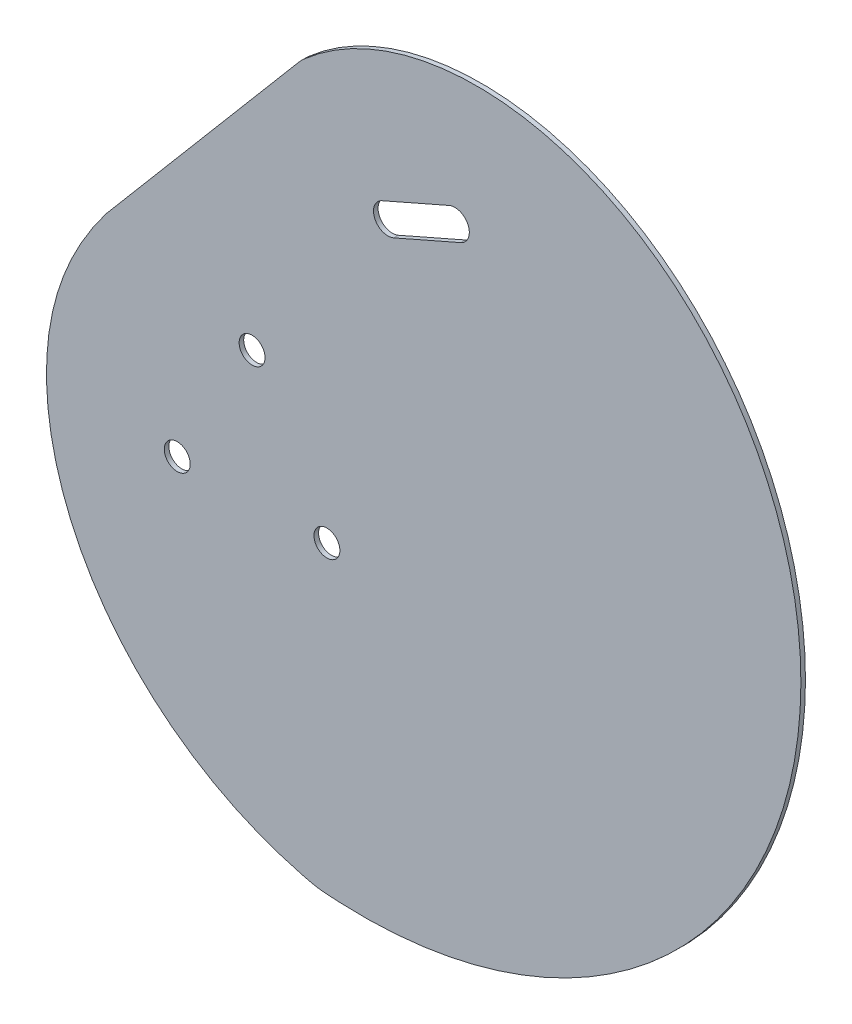
ISO-10303-21;
HEADER;
FILE_DESCRIPTION(('STEP AP214'),'2;1');
FILE_NAME('part.step','',(''),(''),'','','');
FILE_SCHEMA(('AUTOMOTIVE_DESIGN { 1 0 10303 214 1 1 1 1 }'));
ENDSEC;
DATA;
#1=APPLICATION_CONTEXT('core data for automotive mechanical design processes');
#2=APPLICATION_PROTOCOL_DEFINITION('international standard','automotive_design',2000,#1);
#3=PRODUCT_CONTEXT('',#1,'mechanical');
#4=PRODUCT('Part','Part','',(#3));
#5=PRODUCT_RELATED_PRODUCT_CATEGORY('part','',(#4));
#6=PRODUCT_DEFINITION_FORMATION('','',#4);
#7=PRODUCT_DEFINITION_CONTEXT('part definition',#1,'design');
#8=PRODUCT_DEFINITION('design','',#6,#7);
#9=PRODUCT_DEFINITION_SHAPE('','',#8);
#10=(LENGTH_UNIT() NAMED_UNIT(*) SI_UNIT(.MILLI.,.METRE.));
#11=(NAMED_UNIT(*) PLANE_ANGLE_UNIT() SI_UNIT($,.RADIAN.));
#12=(NAMED_UNIT(*) SI_UNIT($,.STERADIAN.) SOLID_ANGLE_UNIT());
#13=UNCERTAINTY_MEASURE_WITH_UNIT(LENGTH_MEASURE(1.E-05),#10,'distance_accuracy_value','');
#14=(GEOMETRIC_REPRESENTATION_CONTEXT(3) GLOBAL_UNCERTAINTY_ASSIGNED_CONTEXT((#13)) GLOBAL_UNIT_ASSIGNED_CONTEXT((#10,
#11,#12)) REPRESENTATION_CONTEXT('',''));
#15=CARTESIAN_POINT('',(0.,0.,0.));
#16=DIRECTION('',(0.,0.,1.));
#17=DIRECTION('',(1.,0.,0.));
#18=AXIS2_PLACEMENT_3D('',#15,#16,#17);
#19=CARTESIAN_POINT('',(0.,0.,0.396875));
#20=DIRECTION('',(0.,0.,1.));
#21=DIRECTION('',(1.,0.,0.));
#22=AXIS2_PLACEMENT_3D('',#19,#20,#21);
#23=PLANE('',#22);
#24=CARTESIAN_POINT('',(-12.5939001772955,-1.27258597502269,0.396875));
#25=DIRECTION('',(0.,0.,1.));
#26=DIRECTION('',(1.,0.,0.));
#27=AXIS2_PLACEMENT_3D('',#24,#25,#26);
#28=CIRCLE('',#27,2.25);
#29=CARTESIAN_POINT('',(-10.3439001772955,-1.27258597502269,0.396875));
#30=VERTEX_POINT('',#29);
#31=EDGE_CURVE('E109',#30,#30,#28,.T.);
#32=ORIENTED_EDGE('',*,*,#31,.F.);
#33=EDGE_LOOP('',(#32));
#34=FACE_BOUND('',#33,.T.);
#35=CARTESIAN_POINT('',(0.396480879471766,-23.7725859750223,0.396875));
#36=DIRECTION('',(0.,0.,1.));
#37=DIRECTION('',(1.,0.,0.));
#38=AXIS2_PLACEMENT_3D('',#35,#36,#37);
#39=CIRCLE('',#38,2.25);
#40=CARTESIAN_POINT('',(2.64648087947177,-23.7725859750223,0.396875));
#41=VERTEX_POINT('',#40);
#42=EDGE_CURVE('E134',#41,#41,#39,.T.);
#43=ORIENTED_EDGE('',*,*,#42,.F.);
#44=EDGE_LOOP('',(#43));
#45=FACE_BOUND('',#44,.T.);
#46=CARTESIAN_POINT('',(-25.5842812340614,-23.7725859750231,0.396875));
#47=DIRECTION('',(0.,0.,1.));
#48=DIRECTION('',(1.,0.,0.));
#49=AXIS2_PLACEMENT_3D('',#46,#47,#48);
#50=CIRCLE('',#49,2.25);
#51=CARTESIAN_POINT('',(-23.3342812340614,-23.7725859750231,0.396875));
#52=VERTEX_POINT('',#51);
#53=EDGE_CURVE('E140',#52,#52,#50,.T.);
#54=ORIENTED_EDGE('',*,*,#53,.F.);
#55=EDGE_LOOP('',(#54));
#56=FACE_BOUND('',#55,.T.);
#57=CARTESIAN_POINT('',(-1.26128431869605,-76.3889966640853,0.396875));
#58=CARTESIAN_POINT('',(-0.976706935574322,-76.433000958118,0.396875));
#59=CARTESIAN_POINT('',(-0.40570033732491,-76.5002886734785,0.396875));
#60=CARTESIAN_POINT('',(0.205282970299483,-76.5431286550552,0.396875));
#61=CARTESIAN_POINT('',(0.635947632892369,-76.5659234882829,0.396875));
#62=CARTESIAN_POINT('',(0.943803395898629,-76.5837536992732,0.396875));
#63=CARTESIAN_POINT('',(1.51657766798327,-76.6253526449032,0.396875));
#64=CARTESIAN_POINT('',(2.39472861708088,-76.6794226518138,0.396875));
#65=CARTESIAN_POINT('',(3.1808192769605,-76.7137003743502,0.396875));
#66=CARTESIAN_POINT('',(4.19803699961454,-76.75168724619,0.396875));
#67=CARTESIAN_POINT('',(6.0521406389918,-76.7942720929503,0.396875));
#68=CARTESIAN_POINT('',(8.65531896727179,-76.7757899651055,0.396875));
#69=CARTESIAN_POINT('',(11.7992302850273,-76.631186753929,0.396875));
#70=CARTESIAN_POINT('',(14.9308116076091,-76.362150817123,0.396875));
#71=CARTESIAN_POINT('',(19.0927292822368,-75.8376989684194,0.396875));
#72=CARTESIAN_POINT('',(24.2526003043896,-74.8709042385839,0.396875));
#73=CARTESIAN_POINT('',(30.3366917936986,-73.2151665179252,0.396875));
#74=CARTESIAN_POINT('',(38.2496377184228,-70.3553029330726,0.396875));
#75=CARTESIAN_POINT('',(47.6646576679233,-65.5807106727296,0.396875));
#76=CARTESIAN_POINT('',(57.8782405742599,-58.0526588499173,0.396875));
#77=CARTESIAN_POINT('',(69.6472472290832,-45.8604490127679,0.396875));
#78=CARTESIAN_POINT('',(80.1730162895738,-27.1334514768673,0.396875));
#79=CARTESIAN_POINT('',(84.2538630410436,-1.50479165459522,0.396875));
#80=CARTESIAN_POINT('',(79.5599947434369,19.8412067482863,0.396875));
#81=CARTESIAN_POINT('',(70.8796865135484,34.9401638956233,0.396875));
#82=CARTESIAN_POINT('',(62.021642873432,44.7053655266334,0.396875));
#83=CARTESIAN_POINT('',(51.0907411074019,52.2640812116842,0.396875));
#84=CARTESIAN_POINT('',(38.576471746608,57.0540859282341,0.396875));
#85=CARTESIAN_POINT('',(25.1004774931715,58.5603822983813,0.396875));
#86=CARTESIAN_POINT('',(13.7708368946147,56.6943293928139,0.396875));
#87=CARTESIAN_POINT('',(5.22574400857566,53.179291685644,0.396875));
#88=CARTESIAN_POINT('',(-0.75748548654271,49.5274645181489,0.396875));
#89=CARTESIAN_POINT('',(-5.17982564226412,45.6481332259453,0.396875));
#90=CARTESIAN_POINT('',(-8.21712868273601,42.3111233056651,0.396875));
#91=CARTESIAN_POINT('',(-10.2837476793927,39.7285564460287,0.396875));
#92=CARTESIAN_POINT('',(-12.1453981413637,37.1299230221057,0.396875));
#93=CARTESIAN_POINT('',(-13.803593656072,34.6302202411006,0.396875));
#94=CARTESIAN_POINT('',(-15.0263666385234,32.7872172676154,0.396875));
#95=CARTESIAN_POINT('',(-15.757749026262,31.8150435741405,0.396875));
#96=CARTESIAN_POINT('',(-16.4572837085939,31.0087975471452,0.396875));
#97=CARTESIAN_POINT('',(-17.3148530430872,30.2124256121384,0.396875));
#98=CARTESIAN_POINT('',(-18.8320987171928,29.1405411562789,0.396875));
#99=CARTESIAN_POINT('',(-20.5794335453912,27.9210149954297,0.396875));
#100=CARTESIAN_POINT('',(-21.8514483213816,26.9528121584477,0.396875));
#101=CARTESIAN_POINT('',(-22.9229134864311,26.0255763335065,0.396875));
#102=CARTESIAN_POINT('',(-23.9113330049711,25.0957745743073,0.396875));
#103=CARTESIAN_POINT('',(-25.0438847891512,23.9057178105531,0.396875));
#104=CARTESIAN_POINT('',(-26.2444451597005,22.4769501418682,0.396875));
#105=CARTESIAN_POINT('',(-27.6678771544237,20.6032078316902,0.396875));
#106=CARTESIAN_POINT('',(-29.1662720153948,18.3817060593167,0.396875));
#107=CARTESIAN_POINT('',(-30.6820035254275,16.0304898055358,0.396875));
#108=CARTESIAN_POINT('',(-31.8417450158577,14.3234191557175,0.396875));
#109=CARTESIAN_POINT('',(-32.7929265221825,13.0258719381619,0.396875));
#110=CARTESIAN_POINT('',(-33.7609917005133,11.7717771176703,0.396875));
#111=CARTESIAN_POINT('',(-35.1935179417244,10.0318274989824,0.396875));
#112=CARTESIAN_POINT('',(-37.0947743542895,7.68858611063458,0.396875));
#113=CARTESIAN_POINT('',(-39.6505131759334,4.30610185058949,0.396875));
#114=CARTESIAN_POINT('',(-42.6514237523282,-0.366044153239744,0.396875));
#115=CARTESIAN_POINT('',(-45.5355557594005,-6.54725137287064,0.396875));
#116=CARTESIAN_POINT('',(-47.5029702487626,-13.2116577754802,0.396875));
#117=CARTESIAN_POINT('',(-48.6844974640878,-22.3699096817478,0.396875));
#118=CARTESIAN_POINT('',(-47.6098868039418,-33.7322087237693,0.396875));
#119=CARTESIAN_POINT('',(-42.8642408139455,-46.3451326435725,0.396875));
#120=CARTESIAN_POINT('',(-36.5641298213063,-55.4680273522898,0.396875));
#121=CARTESIAN_POINT('',(-30.4296575788591,-61.7275262732319,0.396875));
#122=CARTESIAN_POINT('',(-25.3568115028753,-65.8672301951248,0.396875));
#123=CARTESIAN_POINT('',(-20.7978951820845,-68.8298585097831,0.396875));
#124=CARTESIAN_POINT('',(-16.9868888228126,-70.8972783811654,0.396875));
#125=CARTESIAN_POINT('',(-14.0571261532245,-72.2940624730244,0.396875));
#126=CARTESIAN_POINT('',(-11.0574897827893,-73.537247470639,0.396875));
#127=CARTESIAN_POINT('',(-8.52863978148638,-74.4382486629739,0.396875));
#128=CARTESIAN_POINT('',(-6.7053553577977,-75.0088395123344,0.396875));
#129=CARTESIAN_POINT('',(-5.69991861950379,-75.3033007427362,0.396875));
#130=CARTESIAN_POINT('',(-4.91466346108121,-75.5253296610727,0.396875));
#131=CARTESIAN_POINT('',(-4.04372816904597,-75.7517503026063,0.396875));
#132=CARTESIAN_POINT('',(-3.47701846483031,-75.8911528901832,0.396875));
#133=CARTESIAN_POINT('',(-3.15620305968882,-75.9746877031505,0.396875));
#134=CARTESIAN_POINT('',(-2.71872815087296,-76.0895979552755,0.396875));
#135=CARTESIAN_POINT('',(-2.11316463605528,-76.2362629092826,0.396875));
#136=CARTESIAN_POINT('',(-1.54586170181775,-76.3449923700527,0.396875));
#137=CARTESIAN_POINT('',(-1.26128431869605,-76.3889966640853,0.396875));
#138=B_SPLINE_CURVE_WITH_KNOTS('',3,(#57,#58,#59,#60,#61,#62,#63,#64,#65,#66,#67,#68,#69,#70,
#71,#72,#73,#74,#75,#76,#77,#78,#79,#80,#81,#82,#83,#84,#85,#86,#87,#88,#89,#90,#91,#92,#93,#94,
#95,#96,#97,#98,#99,#100,#101,#102,#103,#104,#105,#106,#107,#108,#109,#110,#111,#112,#113,#114,
#115,#116,#117,#118,#119,#120,#121,#122,#123,#124,#125,#126,#127,#128,#129,#130,#131,#132,#133,
#134,#135,#136,#137),.UNSPECIFIED.,.T.,.F.,(4,1,1,1,1,1,1,1,1,1,1,1,1,1,1,1,1,1,1,1,1,1,1,1,1,1,
1,1,1,1,1,1,1,1,1,1,1,1,1,1,1,1,1,1,1,1,1,1,1,1,1,1,1,1,1,1,1,1,1,1,1,1,1,1,1,1,1,1,1,1,1,1,1,1,
1,1,1,1,4),(0.,0.0009765625,0.001953125,0.0029296875,0.00390625,0.005859375,0.0078125,
0.009765625,0.01171875,0.015625,0.0234375,0.03125,0.0390625,0.046875,0.0625,0.078125,0.09375,
0.125,0.15625,0.1875,0.25,0.3125,0.375,0.40625,0.4375,0.46875,0.5,0.53125,0.5625,0.578125,
0.59375,0.609375,0.6171875,0.625,0.6328125,0.640625,0.6484375,0.65234375,0.65625,0.6640625,
0.671875,0.67578125,0.6796875,0.681640625,0.68359375,0.6875,0.69140625,0.6953125,0.703125,
0.7109375,0.71875,0.72265625,0.7265625,0.734375,0.7421875,0.75,0.765625,0.78125,0.796875,0.8125,
0.84375,0.875,0.90625,0.921875,0.9375,0.953125,0.9609375,0.96875,0.9765625,0.984375,0.98828125,
0.990234375,0.9921875,0.994140625,0.99609375,0.9970703125,0.998046875,0.9990234375,1.),.UNSPECIFIED.);
#139=CARTESIAN_POINT('',(-37.9799857120954,6.50792390325195,0.396875));
#140=VERTEX_POINT('',#139);
#141=CARTESIAN_POINT('',(-3.53695857470606,47.0282576025844,0.396875));
#142=VERTEX_POINT('',#141);
#143=EDGE_CURVE('E153',#140,#142,#138,.T.);
#144=ORIENTED_EDGE('',*,*,#143,.T.);
#145=CARTESIAN_POINT('',(3.06845796283441,39.5203635992312,0.396875));
#146=DIRECTION('',(0.,0.,1.));
#147=DIRECTION('',(1.,0.,0.));
#148=AXIS2_PLACEMENT_3D('',#145,#146,#147);
#149=CIRCLE('',#148,10.);
#150=CARTESIAN_POINT('',(-4.56394467477297,45.9815113283459,0.396875));
#151=VERTEX_POINT('',#150);
#152=EDGE_CURVE('E308',#142,#151,#149,.T.);
#153=ORIENTED_EDGE('',*,*,#152,.T.);
#154=DIRECTION('',(0.64611477291147,0.763240263760737,0.));
#155=VECTOR('',#154,1.);
#156=CARTESIAN_POINT('',(-4.11931026186588,46.506747556973,0.396875));
#157=LINE('',#156,#155);
#158=EDGE_CURVE('E146',#140,#151,#157,.T.);
#159=ORIENTED_EDGE('',*,*,#158,.F.);
#160=EDGE_LOOP('',(#144,#153,#159));
#161=FACE_BOUND('',#160,.T.);
#162=DIRECTION('',(0.915739274242188,0.401773047391671,0.));
#163=VECTOR('',#162,1.);
#164=CARTESIAN_POINT('',(11.9849141806537,27.8957335836621,0.396875));
#165=LINE('',#164,#163);
#166=CARTESIAN_POINT('',(11.9849141806537,27.8957335836621,0.396875));
#167=VERTEX_POINT('',#166);
#168=CARTESIAN_POINT('',(23.6148029635294,32.9982512855363,0.396875));
#169=VERTEX_POINT('',#168);
#170=EDGE_CURVE('E101',#167,#169,#165,.T.);
#171=ORIENTED_EDGE('',*,*,#170,.F.);
#172=CARTESIAN_POINT('',(10.9804815621745,30.1850817692675,0.396875));
#173=DIRECTION('',(0.,0.,1.));
#174=DIRECTION('',(1.,0.,0.));
#175=AXIS2_PLACEMENT_3D('',#172,#173,#174);
#176=CIRCLE('',#175,2.5);
#177=CARTESIAN_POINT('',(9.97604894369531,32.474429954873,0.396875));
#178=VERTEX_POINT('',#177);
#179=EDGE_CURVE('E93',#178,#167,#176,.T.);
#180=ORIENTED_EDGE('',*,*,#179,.F.);
#181=DIRECTION('',(-0.915739274242188,-0.401773047391673,0.));
#182=VECTOR('',#181,1.);
#183=CARTESIAN_POINT('',(9.97604894369531,32.474429954873,0.396875));
#184=LINE('',#183,#182);
#185=CARTESIAN_POINT('',(21.6059377265711,37.5769476567472,0.396875));
#186=VERTEX_POINT('',#185);
#187=EDGE_CURVE('E115',#186,#178,#184,.T.);
#188=ORIENTED_EDGE('',*,*,#187,.F.);
#189=CARTESIAN_POINT('',(22.6103703450502,35.2875994711417,0.396875));
#190=DIRECTION('',(0.,0.,1.));
#191=DIRECTION('',(1.,0.,0.));
#192=AXIS2_PLACEMENT_3D('',#189,#190,#191);
#193=CIRCLE('',#192,2.50000000000002);
#194=EDGE_CURVE('E113',#169,#186,#193,.T.);
#195=ORIENTED_EDGE('',*,*,#194,.F.);
#196=EDGE_LOOP('',(#171,#180,#188,#195));
#197=FACE_BOUND('',#196,.T.);
#198=ADVANCED_FACE('F35',(#34,#45,#56,#161,#197),#23,.T.);
#199=CARTESIAN_POINT('',(0.,0.,-0.396875));
#200=DIRECTION('',(0.,0.,1.));
#201=DIRECTION('',(1.,0.,0.));
#202=AXIS2_PLACEMENT_3D('',#199,#200,#201);
#203=PLANE('',#202);
#204=DIRECTION('',(0.64611477291147,0.763240263760737,0.));
#205=VECTOR('',#204,1.);
#206=CARTESIAN_POINT('',(-25.3340204344462,21.4463068015867,-0.396875));
#207=LINE('',#206,#205);
#208=CARTESIAN_POINT('',(-37.9799857120954,6.50792390325195,-0.396875));
#209=VERTEX_POINT('',#208);
#210=CARTESIAN_POINT('',(-4.56394467477297,45.9815113283459,-0.396875));
#211=VERTEX_POINT('',#210);
#212=EDGE_CURVE('E159',#209,#211,#207,.T.);
#213=ORIENTED_EDGE('',*,*,#212,.T.);
#214=CARTESIAN_POINT('',(3.06845796283441,39.5203635992312,-0.396875));
#215=DIRECTION('',(0.,0.,1.));
#216=DIRECTION('',(1.,0.,0.));
#217=AXIS2_PLACEMENT_3D('',#214,#215,#216);
#218=CIRCLE('',#217,10.);
#219=CARTESIAN_POINT('',(-3.53695857470606,47.0282576025844,-0.396875));
#220=VERTEX_POINT('',#219);
#221=EDGE_CURVE('E11',#211,#220,#218,.F.);
#222=ORIENTED_EDGE('',*,*,#221,.T.);
#223=CARTESIAN_POINT('',(-1.26128431869605,-76.3889966640853,-0.396875));
#224=CARTESIAN_POINT('',(-0.976706935574322,-76.433000958118,-0.396875));
#225=CARTESIAN_POINT('',(-0.40570033732491,-76.5002886734785,-0.396875));
#226=CARTESIAN_POINT('',(0.205282970299483,-76.5431286550552,-0.396875));
#227=CARTESIAN_POINT('',(0.635947632892369,-76.5659234882829,-0.396875));
#228=CARTESIAN_POINT('',(0.943803395898629,-76.5837536992732,-0.396875));
#229=CARTESIAN_POINT('',(1.51657766798327,-76.6253526449032,-0.396875));
#230=CARTESIAN_POINT('',(2.39472861708088,-76.6794226518138,-0.396875));
#231=CARTESIAN_POINT('',(3.1808192769605,-76.7137003743502,-0.396875));
#232=CARTESIAN_POINT('',(4.19803699961454,-76.75168724619,-0.396875));
#233=CARTESIAN_POINT('',(6.0521406389918,-76.7942720929503,-0.396875));
#234=CARTESIAN_POINT('',(8.65531896727179,-76.7757899651055,-0.396875));
#235=CARTESIAN_POINT('',(11.7992302850273,-76.631186753929,-0.396875));
#236=CARTESIAN_POINT('',(14.9308116076091,-76.362150817123,-0.396875));
#237=CARTESIAN_POINT('',(19.0927292822368,-75.8376989684194,-0.396875));
#238=CARTESIAN_POINT('',(24.2526003043896,-74.8709042385839,-0.396875));
#239=CARTESIAN_POINT('',(30.3366917936986,-73.2151665179252,-0.396875));
#240=CARTESIAN_POINT('',(38.2496377184228,-70.3553029330726,-0.396875));
#241=CARTESIAN_POINT('',(47.6646576679233,-65.5807106727296,-0.396875));
#242=CARTESIAN_POINT('',(57.8782405742599,-58.0526588499173,-0.396875));
#243=CARTESIAN_POINT('',(69.6472472290832,-45.8604490127679,-0.396875));
#244=CARTESIAN_POINT('',(80.1730162895738,-27.1334514768673,-0.396875));
#245=CARTESIAN_POINT('',(84.2538630410436,-1.50479165459522,-0.396875));
#246=CARTESIAN_POINT('',(79.5599947434369,19.8412067482863,-0.396875));
#247=CARTESIAN_POINT('',(70.8796865135484,34.9401638956233,-0.396875));
#248=CARTESIAN_POINT('',(62.021642873432,44.7053655266334,-0.396875));
#249=CARTESIAN_POINT('',(51.0907411074019,52.2640812116842,-0.396875));
#250=CARTESIAN_POINT('',(38.576471746608,57.0540859282341,-0.396875));
#251=CARTESIAN_POINT('',(25.1004774931715,58.5603822983813,-0.396875));
#252=CARTESIAN_POINT('',(13.7708368946147,56.6943293928139,-0.396875));
#253=CARTESIAN_POINT('',(5.22574400857566,53.179291685644,-0.396875));
#254=CARTESIAN_POINT('',(-0.75748548654271,49.5274645181489,-0.396875));
#255=CARTESIAN_POINT('',(-5.17982564226412,45.6481332259453,-0.396875));
#256=CARTESIAN_POINT('',(-8.21712868273601,42.3111233056651,-0.396875));
#257=CARTESIAN_POINT('',(-10.2837476793927,39.7285564460287,-0.396875));
#258=CARTESIAN_POINT('',(-12.1453981413637,37.1299230221057,-0.396875));
#259=CARTESIAN_POINT('',(-13.803593656072,34.6302202411006,-0.396875));
#260=CARTESIAN_POINT('',(-15.0263666385234,32.7872172676154,-0.396875));
#261=CARTESIAN_POINT('',(-15.757749026262,31.8150435741405,-0.396875));
#262=CARTESIAN_POINT('',(-16.4572837085939,31.0087975471452,-0.396875));
#263=CARTESIAN_POINT('',(-17.3148530430872,30.2124256121384,-0.396875));
#264=CARTESIAN_POINT('',(-18.8320987171928,29.1405411562789,-0.396875));
#265=CARTESIAN_POINT('',(-20.5794335453912,27.9210149954297,-0.396875));
#266=CARTESIAN_POINT('',(-21.8514483213816,26.9528121584477,-0.396875));
#267=CARTESIAN_POINT('',(-22.9229134864311,26.0255763335065,-0.396875));
#268=CARTESIAN_POINT('',(-23.9113330049711,25.0957745743073,-0.396875));
#269=CARTESIAN_POINT('',(-25.0438847891512,23.9057178105531,-0.396875));
#270=CARTESIAN_POINT('',(-26.2444451597005,22.4769501418682,-0.396875));
#271=CARTESIAN_POINT('',(-27.6678771544237,20.6032078316902,-0.396875));
#272=CARTESIAN_POINT('',(-29.1662720153948,18.3817060593167,-0.396875));
#273=CARTESIAN_POINT('',(-30.6820035254275,16.0304898055358,-0.396875));
#274=CARTESIAN_POINT('',(-31.8417450158577,14.3234191557175,-0.396875));
#275=CARTESIAN_POINT('',(-32.7929265221825,13.0258719381619,-0.396875));
#276=CARTESIAN_POINT('',(-33.7609917005133,11.7717771176703,-0.396875));
#277=CARTESIAN_POINT('',(-35.1935179417244,10.0318274989824,-0.396875));
#278=CARTESIAN_POINT('',(-37.0947743542895,7.68858611063458,-0.396875));
#279=CARTESIAN_POINT('',(-39.6505131759334,4.30610185058949,-0.396875));
#280=CARTESIAN_POINT('',(-42.6514237523282,-0.366044153239744,-0.396875));
#281=CARTESIAN_POINT('',(-45.5355557594005,-6.54725137287064,-0.396875));
#282=CARTESIAN_POINT('',(-47.5029702487626,-13.2116577754802,-0.396875));
#283=CARTESIAN_POINT('',(-48.6844974640878,-22.3699096817478,-0.396875));
#284=CARTESIAN_POINT('',(-47.6098868039418,-33.7322087237693,-0.396875));
#285=CARTESIAN_POINT('',(-42.8642408139455,-46.3451326435725,-0.396875));
#286=CARTESIAN_POINT('',(-36.5641298213063,-55.4680273522898,-0.396875));
#287=CARTESIAN_POINT('',(-30.4296575788591,-61.7275262732319,-0.396875));
#288=CARTESIAN_POINT('',(-25.3568115028753,-65.8672301951248,-0.396875));
#289=CARTESIAN_POINT('',(-20.7978951820845,-68.8298585097831,-0.396875));
#290=CARTESIAN_POINT('',(-16.9868888228126,-70.8972783811654,-0.396875));
#291=CARTESIAN_POINT('',(-14.0571261532245,-72.2940624730244,-0.396875));
#292=CARTESIAN_POINT('',(-11.0574897827893,-73.537247470639,-0.396875));
#293=CARTESIAN_POINT('',(-8.52863978148638,-74.4382486629739,-0.396875));
#294=CARTESIAN_POINT('',(-6.7053553577977,-75.0088395123344,-0.396875));
#295=CARTESIAN_POINT('',(-5.69991861950379,-75.3033007427362,-0.396875));
#296=CARTESIAN_POINT('',(-4.91466346108121,-75.5253296610727,-0.396875));
#297=CARTESIAN_POINT('',(-4.04372816904597,-75.7517503026063,-0.396875));
#298=CARTESIAN_POINT('',(-3.47701846483031,-75.8911528901832,-0.396875));
#299=CARTESIAN_POINT('',(-3.15620305968882,-75.9746877031505,-0.396875));
#300=CARTESIAN_POINT('',(-2.71872815087296,-76.0895979552755,-0.396875));
#301=CARTESIAN_POINT('',(-2.11316463605528,-76.2362629092826,-0.396875));
#302=CARTESIAN_POINT('',(-1.54586170181775,-76.3449923700527,-0.396875));
#303=CARTESIAN_POINT('',(-1.26128431869605,-76.3889966640853,-0.396875));
#304=B_SPLINE_CURVE_WITH_KNOTS('',3,(#223,#224,#225,#226,#227,#228,#229,#230,#231,#232,#233,
#234,#235,#236,#237,#238,#239,#240,#241,#242,#243,#244,#245,#246,#247,#248,#249,#250,#251,#252,
#253,#254,#255,#256,#257,#258,#259,#260,#261,#262,#263,#264,#265,#266,#267,#268,#269,#270,#271,
#272,#273,#274,#275,#276,#277,#278,#279,#280,#281,#282,#283,#284,#285,#286,#287,#288,#289,#290,
#291,#292,#293,#294,#295,#296,#297,#298,#299,#300,#301,#302,#303),.UNSPECIFIED.,.T.,.F.,(4,1,1,
1,1,1,1,1,1,1,1,1,1,1,1,1,1,1,1,1,1,1,1,1,1,1,1,1,1,1,1,1,1,1,1,1,1,1,1,1,1,1,1,1,1,1,1,1,1,1,1,
1,1,1,1,1,1,1,1,1,1,1,1,1,1,1,1,1,1,1,1,1,1,1,1,1,1,1,4),(0.,0.0009765625,0.001953125,
0.0029296875,0.00390625,0.005859375,0.0078125,0.009765625,0.01171875,0.015625,0.0234375,0.03125,
0.0390625,0.046875,0.0625,0.078125,0.09375,0.125,0.15625,0.1875,0.25,0.3125,0.375,0.40625,
0.4375,0.46875,0.5,0.53125,0.5625,0.578125,0.59375,0.609375,0.6171875,0.625,0.6328125,0.640625,
0.6484375,0.65234375,0.65625,0.6640625,0.671875,0.67578125,0.6796875,0.681640625,0.68359375,
0.6875,0.69140625,0.6953125,0.703125,0.7109375,0.71875,0.72265625,0.7265625,0.734375,0.7421875,
0.75,0.765625,0.78125,0.796875,0.8125,0.84375,0.875,0.90625,0.921875,0.9375,0.953125,0.9609375,
0.96875,0.9765625,0.984375,0.98828125,0.990234375,0.9921875,0.994140625,0.99609375,0.9970703125,
0.998046875,0.9990234375,1.),.UNSPECIFIED.);
#305=EDGE_CURVE('E152',#209,#220,#304,.T.);
#306=ORIENTED_EDGE('',*,*,#305,.F.);
#307=EDGE_LOOP('',(#213,#222,#306));
#308=FACE_BOUND('',#307,.T.);
#309=CARTESIAN_POINT('',(-25.5842812340614,-23.7725859750231,-0.396875));
#310=DIRECTION('',(0.,0.,1.));
#311=DIRECTION('',(1.,0.,0.));
#312=AXIS2_PLACEMENT_3D('',#309,#310,#311);
#313=CIRCLE('',#312,2.25);
#314=CARTESIAN_POINT('',(-23.3342812340614,-23.7725859750231,-0.396875));
#315=VERTEX_POINT('',#314);
#316=EDGE_CURVE('E143',#315,#315,#313,.T.);
#317=ORIENTED_EDGE('',*,*,#316,.T.);
#318=EDGE_LOOP('',(#317));
#319=FACE_BOUND('',#318,.T.);
#320=CARTESIAN_POINT('',(0.396480879471766,-23.7725859750223,-0.396875));
#321=DIRECTION('',(0.,0.,1.));
#322=DIRECTION('',(1.,0.,0.));
#323=AXIS2_PLACEMENT_3D('',#320,#321,#322);
#324=CIRCLE('',#323,2.25);
#325=CARTESIAN_POINT('',(2.64648087947177,-23.7725859750223,-0.396875));
#326=VERTEX_POINT('',#325);
#327=EDGE_CURVE('E137',#326,#326,#324,.T.);
#328=ORIENTED_EDGE('',*,*,#327,.T.);
#329=EDGE_LOOP('',(#328));
#330=FACE_BOUND('',#329,.T.);
#331=CARTESIAN_POINT('',(-12.5939001772955,-1.27258597502269,-0.396875));
#332=DIRECTION('',(0.,0.,1.));
#333=DIRECTION('',(1.,0.,0.));
#334=AXIS2_PLACEMENT_3D('',#331,#332,#333);
#335=CIRCLE('',#334,2.25);
#336=CARTESIAN_POINT('',(-10.3439001772955,-1.27258597502269,-0.396875));
#337=VERTEX_POINT('',#336);
#338=EDGE_CURVE('E131',#337,#337,#335,.T.);
#339=ORIENTED_EDGE('',*,*,#338,.T.);
#340=EDGE_LOOP('',(#339));
#341=FACE_BOUND('',#340,.T.);
#342=CARTESIAN_POINT('',(10.9804815621745,30.1850817692675,-0.396874999999852));
#343=DIRECTION('',(0.,0.,1.));
#344=DIRECTION('',(1.,0.,0.));
#345=AXIS2_PLACEMENT_3D('',#342,#343,#344);
#346=CIRCLE('',#345,2.5);
#347=CARTESIAN_POINT('',(9.97604894369531,32.474429954873,-0.396875));
#348=VERTEX_POINT('',#347);
#349=CARTESIAN_POINT('',(11.9849141806537,27.8957335836621,-0.396874999999852));
#350=VERTEX_POINT('',#349);
#351=EDGE_CURVE('E58',#348,#350,#346,.T.);
#352=ORIENTED_EDGE('',*,*,#351,.T.);
#353=DIRECTION('',(0.915739274242188,0.401773047391671,0.));
#354=VECTOR('',#353,1.);
#355=CARTESIAN_POINT('',(11.9849141806537,27.8957335836621,-0.396874999999852));
#356=LINE('',#355,#354);
#357=CARTESIAN_POINT('',(23.6148029635294,32.9982512855363,-0.396874999999852));
#358=VERTEX_POINT('',#357);
#359=EDGE_CURVE('E108',#350,#358,#356,.T.);
#360=ORIENTED_EDGE('',*,*,#359,.T.);
#361=CARTESIAN_POINT('',(22.6103703450502,35.2875994711417,-0.396874999999852));
#362=DIRECTION('',(0.,0.,1.));
#363=DIRECTION('',(1.,0.,0.));
#364=AXIS2_PLACEMENT_3D('',#361,#362,#363);
#365=CIRCLE('',#364,2.50000000000002);
#366=CARTESIAN_POINT('',(21.6059377265711,37.5769476567472,-0.396874999999852));
#367=VERTEX_POINT('',#366);
#368=EDGE_CURVE('E121',#358,#367,#365,.T.);
#369=ORIENTED_EDGE('',*,*,#368,.T.);
#370=DIRECTION('',(-0.915739274242188,-0.401773047391673,0.));
#371=VECTOR('',#370,1.);
#372=CARTESIAN_POINT('',(9.97604894369531,32.474429954873,-0.396874999999852));
#373=LINE('',#372,#371);
#374=EDGE_CURVE('E102',#367,#348,#373,.T.);
#375=ORIENTED_EDGE('',*,*,#374,.T.);
#376=EDGE_LOOP('',(#352,#360,#369,#375));
#377=FACE_BOUND('',#376,.T.);
#378=ADVANCED_FACE('F170',(#308,#319,#330,#341,#377),#203,.F.);
#379=DIRECTION('',(0.,0.,-1.));
#380=VECTOR('',#379,1.);
#381=SURFACE_OF_LINEAR_EXTRUSION('',#138,#380);
#382=ORIENTED_EDGE('',*,*,#305,.T.);
#383=DIRECTION('',(0.,0.,-1.));
#384=VECTOR('',#383,1.);
#385=CARTESIAN_POINT('',(-3.53695857470606,47.0282576025844,-0.396875));
#386=LINE('',#385,#384);
#387=EDGE_CURVE('E301',#220,#142,#386,.F.);
#388=ORIENTED_EDGE('',*,*,#387,.T.);
#389=ORIENTED_EDGE('',*,*,#143,.F.);
#390=DIRECTION('',(0.,0.,1.));
#391=VECTOR('',#390,1.);
#392=CARTESIAN_POINT('',(-37.9799857120954,6.50792390325195,-0.396875));
#393=LINE('',#392,#391);
#394=EDGE_CURVE('E149',#209,#140,#393,.T.);
#395=ORIENTED_EDGE('',*,*,#394,.F.);
#396=EDGE_LOOP('',(#382,#388,#389,#395));
#397=FACE_BOUND('',#396,.T.);
#398=ADVANCED_FACE('F166',(#397),#381,.F.);
#399=CARTESIAN_POINT('',(-4.11931026186588,46.506747556973,-0.396875));
#400=DIRECTION('',(0.763240263760737,-0.64611477291147,0.));
#401=DIRECTION('',(0.64611477291147,0.763240263760737,0.));
#402=AXIS2_PLACEMENT_3D('',#399,#400,#401);
#403=PLANE('',#402);
#404=ORIENTED_EDGE('',*,*,#158,.T.);
#405=DIRECTION('',(0.,0.,-1.));
#406=VECTOR('',#405,1.);
#407=CARTESIAN_POINT('',(-4.56394467477297,45.9815113283459,-0.396875));
#408=LINE('',#407,#406);
#409=EDGE_CURVE('E43',#151,#211,#408,.T.);
#410=ORIENTED_EDGE('',*,*,#409,.T.);
#411=ORIENTED_EDGE('',*,*,#212,.F.);
#412=ORIENTED_EDGE('',*,*,#394,.T.);
#413=EDGE_LOOP('',(#404,#410,#411,#412));
#414=FACE_BOUND('',#413,.T.);
#415=ADVANCED_FACE('F169',(#414),#403,.F.);
#416=CARTESIAN_POINT('',(-25.5842812340614,-23.7725859750231,0.396875));
#417=DIRECTION('',(0.,0.,1.));
#418=DIRECTION('',(1.,0.,0.));
#419=AXIS2_PLACEMENT_3D('',#416,#417,#418);
#420=CYLINDRICAL_SURFACE('',#419,2.25);
#421=ORIENTED_EDGE('',*,*,#316,.F.);
#422=EDGE_LOOP('',(#421));
#423=FACE_BOUND('',#422,.T.);
#424=ORIENTED_EDGE('',*,*,#53,.T.);
#425=EDGE_LOOP('',(#424));
#426=FACE_BOUND('',#425,.T.);
#427=ADVANCED_FACE('F180',(#423,#426),#420,.F.);
#428=CARTESIAN_POINT('',(0.396480879471766,-23.7725859750223,0.396875));
#429=DIRECTION('',(0.,0.,1.));
#430=DIRECTION('',(1.,0.,0.));
#431=AXIS2_PLACEMENT_3D('',#428,#429,#430);
#432=CYLINDRICAL_SURFACE('',#431,2.25);
#433=ORIENTED_EDGE('',*,*,#327,.F.);
#434=EDGE_LOOP('',(#433));
#435=FACE_BOUND('',#434,.T.);
#436=ORIENTED_EDGE('',*,*,#42,.T.);
#437=EDGE_LOOP('',(#436));
#438=FACE_BOUND('',#437,.T.);
#439=ADVANCED_FACE('F184',(#435,#438),#432,.F.);
#440=CARTESIAN_POINT('',(-12.5939001772955,-1.27258597502269,0.396875));
#441=DIRECTION('',(0.,0.,1.));
#442=DIRECTION('',(1.,0.,0.));
#443=AXIS2_PLACEMENT_3D('',#440,#441,#442);
#444=CYLINDRICAL_SURFACE('',#443,2.25);
#445=ORIENTED_EDGE('',*,*,#338,.F.);
#446=EDGE_LOOP('',(#445));
#447=FACE_BOUND('',#446,.T.);
#448=ORIENTED_EDGE('',*,*,#31,.T.);
#449=EDGE_LOOP('',(#448));
#450=FACE_BOUND('',#449,.T.);
#451=ADVANCED_FACE('F188',(#447,#450),#444,.F.);
#452=CARTESIAN_POINT('',(3.06845796283441,39.5203635992312,0.));
#453=DIRECTION('',(0.,0.,-1.));
#454=DIRECTION('',(-1.,0.,0.));
#455=AXIS2_PLACEMENT_3D('',#452,#453,#454);
#456=CYLINDRICAL_SURFACE('',#455,10.);
#457=ORIENTED_EDGE('',*,*,#221,.F.);
#458=ORIENTED_EDGE('',*,*,#409,.F.);
#459=ORIENTED_EDGE('',*,*,#152,.F.);
#460=ORIENTED_EDGE('',*,*,#387,.F.);
#461=EDGE_LOOP('',(#457,#458,#459,#460));
#462=FACE_BOUND('',#461,.T.);
#463=ADVANCED_FACE('F37',(#462),#456,.T.);
#464=CARTESIAN_POINT('',(10.9804815621745,30.1850817692675,0.396875));
#465=DIRECTION('',(0.,0.,-1.));
#466=DIRECTION('',(-1.,0.,0.));
#467=AXIS2_PLACEMENT_3D('',#464,#465,#466);
#468=CYLINDRICAL_SURFACE('',#467,2.5);
#469=ORIENTED_EDGE('',*,*,#351,.F.);
#470=DIRECTION('',(0.,0.,-1.));
#471=VECTOR('',#470,1.);
#472=CARTESIAN_POINT('',(9.97604894369531,32.474429954873,0.396875));
#473=LINE('',#472,#471);
#474=EDGE_CURVE('E97',#178,#348,#473,.T.);
#475=ORIENTED_EDGE('',*,*,#474,.F.);
#476=ORIENTED_EDGE('',*,*,#179,.T.);
#477=DIRECTION('',(0.,0.,-1.));
#478=VECTOR('',#477,1.);
#479=CARTESIAN_POINT('',(11.9849141806537,27.8957335836621,0.396875));
#480=LINE('',#479,#478);
#481=EDGE_CURVE('E96',#167,#350,#480,.T.);
#482=ORIENTED_EDGE('',*,*,#481,.T.);
#483=EDGE_LOOP('',(#469,#475,#476,#482));
#484=FACE_BOUND('',#483,.T.);
#485=ADVANCED_FACE('F95',(#484),#468,.F.);
#486=CARTESIAN_POINT('',(11.9849141806537,27.8957335836621,0.396875));
#487=DIRECTION('',(-0.401773047391671,0.915739274242188,0.));
#488=DIRECTION('',(-0.915739274242188,-0.401773047391671,0.));
#489=AXIS2_PLACEMENT_3D('',#486,#487,#488);
#490=PLANE('',#489);
#491=ORIENTED_EDGE('',*,*,#359,.F.);
#492=ORIENTED_EDGE('',*,*,#481,.F.);
#493=ORIENTED_EDGE('',*,*,#170,.T.);
#494=DIRECTION('',(0.,0.,-1.));
#495=VECTOR('',#494,1.);
#496=CARTESIAN_POINT('',(23.6148029635294,32.9982512855363,0.396875));
#497=LINE('',#496,#495);
#498=EDGE_CURVE('E110',#169,#358,#497,.T.);
#499=ORIENTED_EDGE('',*,*,#498,.T.);
#500=EDGE_LOOP('',(#491,#492,#493,#499));
#501=FACE_BOUND('',#500,.T.);
#502=ADVANCED_FACE('F105',(#501),#490,.T.);
#503=CARTESIAN_POINT('',(22.6103703450502,35.2875994711417,0.396875));
#504=DIRECTION('',(0.,0.,-1.));
#505=DIRECTION('',(-1.,0.,0.));
#506=AXIS2_PLACEMENT_3D('',#503,#504,#505);
#507=CYLINDRICAL_SURFACE('',#506,2.50000000000002);
#508=ORIENTED_EDGE('',*,*,#368,.F.);
#509=ORIENTED_EDGE('',*,*,#498,.F.);
#510=ORIENTED_EDGE('',*,*,#194,.T.);
#511=DIRECTION('',(0.,0.,-1.));
#512=VECTOR('',#511,1.);
#513=CARTESIAN_POINT('',(21.6059377265711,37.5769476567472,0.396875));
#514=LINE('',#513,#512);
#515=EDGE_CURVE('E50',#186,#367,#514,.T.);
#516=ORIENTED_EDGE('',*,*,#515,.T.);
#517=EDGE_LOOP('',(#508,#509,#510,#516));
#518=FACE_BOUND('',#517,.T.);
#519=ADVANCED_FACE('F197',(#518),#507,.F.);
#520=CARTESIAN_POINT('',(9.97604894369531,32.474429954873,0.396875));
#521=DIRECTION('',(0.401773047391673,-0.915739274242188,0.));
#522=DIRECTION('',(0.915739274242188,0.401773047391673,0.));
#523=AXIS2_PLACEMENT_3D('',#520,#521,#522);
#524=PLANE('',#523);
#525=ORIENTED_EDGE('',*,*,#374,.F.);
#526=ORIENTED_EDGE('',*,*,#515,.F.);
#527=ORIENTED_EDGE('',*,*,#187,.T.);
#528=ORIENTED_EDGE('',*,*,#474,.T.);
#529=EDGE_LOOP('',(#525,#526,#527,#528));
#530=FACE_BOUND('',#529,.T.);
#531=ADVANCED_FACE('F200',(#530),#524,.T.);
#532=CLOSED_SHELL('',(#198,#378,#398,#415,#427,#439,#451,#463,#485,#502,#519,#531));
#533=MANIFOLD_SOLID_BREP('B2',#532);
#534=ADVANCED_BREP_SHAPE_REPRESENTATION('',(#18,#533),#14);
#535=SHAPE_DEFINITION_REPRESENTATION(#9,#534);
ENDSEC;
END-ISO-10303-21;
